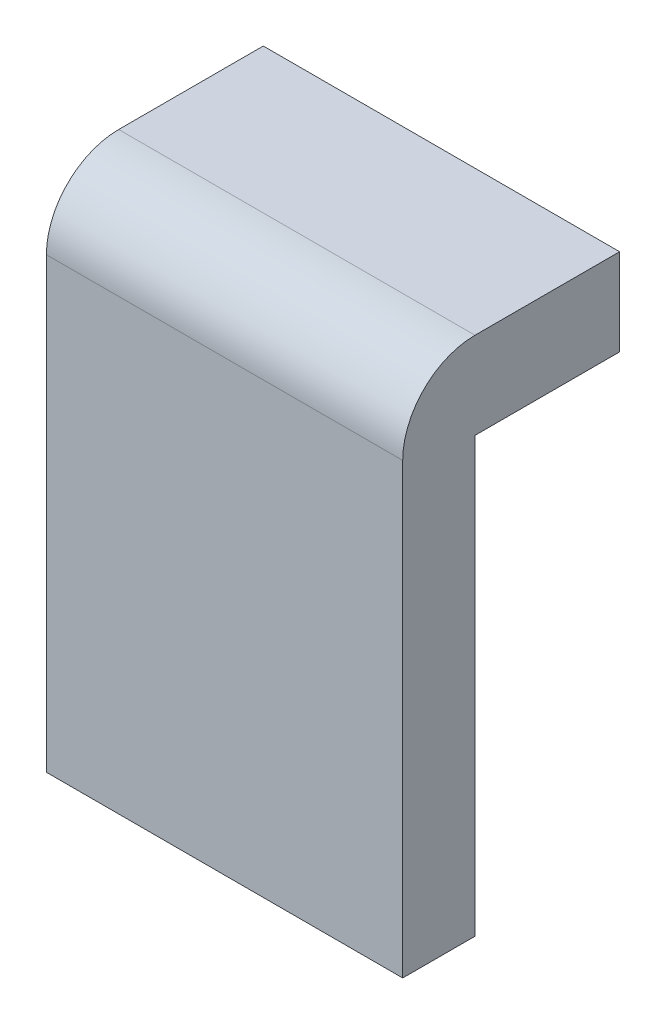
ISO-10303-21;
HEADER;
FILE_DESCRIPTION(('STEP AP214'),'2;1');
FILE_NAME('part.step','',(''),(''),'','','');
FILE_SCHEMA(('AUTOMOTIVE_DESIGN { 1 0 10303 214 1 1 1 1 }'));
ENDSEC;
DATA;
#1=APPLICATION_CONTEXT('core data for automotive mechanical design processes');
#2=APPLICATION_PROTOCOL_DEFINITION('international standard','automotive_design',2000,#1);
#3=PRODUCT_CONTEXT('',#1,'mechanical');
#4=PRODUCT('Part','Part','',(#3));
#5=PRODUCT_RELATED_PRODUCT_CATEGORY('part','',(#4));
#6=PRODUCT_DEFINITION_FORMATION('','',#4);
#7=PRODUCT_DEFINITION_CONTEXT('part definition',#1,'design');
#8=PRODUCT_DEFINITION('design','',#6,#7);
#9=PRODUCT_DEFINITION_SHAPE('','',#8);
#10=(LENGTH_UNIT() NAMED_UNIT(*) SI_UNIT(.MILLI.,.METRE.));
#11=(NAMED_UNIT(*) PLANE_ANGLE_UNIT() SI_UNIT($,.RADIAN.));
#12=(NAMED_UNIT(*) SI_UNIT($,.STERADIAN.) SOLID_ANGLE_UNIT());
#13=UNCERTAINTY_MEASURE_WITH_UNIT(LENGTH_MEASURE(1.E-05),#10,'distance_accuracy_value','');
#14=(GEOMETRIC_REPRESENTATION_CONTEXT(3) GLOBAL_UNCERTAINTY_ASSIGNED_CONTEXT((#13)) GLOBAL_UNIT_ASSIGNED_CONTEXT((#10,
#11,#12)) REPRESENTATION_CONTEXT('',''));
#15=CARTESIAN_POINT('',(0.,0.,0.));
#16=DIRECTION('',(0.,0.,1.));
#17=DIRECTION('',(1.,0.,0.));
#18=AXIS2_PLACEMENT_3D('',#15,#16,#17);
#19=CARTESIAN_POINT('',(-8.34906661620967,8.30000000000001,12.2546737770755));
#20=DIRECTION('',(0.,0.,1.));
#21=DIRECTION('',(0.,-1.,0.));
#22=AXIS2_PLACEMENT_3D('',#19,#20,#21);
#23=PLANE('',#22);
#24=DIRECTION('',(1.,0.,0.));
#25=VECTOR('',#24,1.);
#26=CARTESIAN_POINT('',(-15.8147962412963,6.80000000000003,12.2546737770755));
#27=LINE('',#26,#25);
#28=CARTESIAN_POINT('',(26.7271967977103,6.80000000000003,12.2546737770755));
#29=VERTEX_POINT('',#28);
#30=CARTESIAN_POINT('',(27.959347554151,6.80000000000003,12.2546737770755));
#31=VERTEX_POINT('',#30);
#32=EDGE_CURVE('E113',#29,#31,#27,.T.);
#33=ORIENTED_EDGE('',*,*,#32,.F.);
#34=DIRECTION('',(0.,1.,0.));
#35=VECTOR('',#34,1.);
#36=CARTESIAN_POINT('',(26.7271967977103,5.35753839337147,12.2546737770755));
#37=LINE('',#36,#35);
#38=CARTESIAN_POINT('',(26.7271967977103,8.30000000000001,12.2546737770755));
#39=VERTEX_POINT('',#38);
#40=EDGE_CURVE('E148',#39,#29,#37,.F.);
#41=ORIENTED_EDGE('',*,*,#40,.F.);
#42=DIRECTION('',(1.,0.,0.));
#43=VECTOR('',#42,1.);
#44=CARTESIAN_POINT('',(-8.34906661620967,8.30000000000001,12.2546737770755));
#45=LINE('',#44,#43);
#46=CARTESIAN_POINT('',(27.959347554151,8.30000000000001,12.2546737770755));
#47=VERTEX_POINT('',#46);
#48=EDGE_CURVE('E133',#39,#47,#45,.T.);
#49=ORIENTED_EDGE('',*,*,#48,.T.);
#50=DIRECTION('',(0.,1.,0.));
#51=VECTOR('',#50,1.);
#52=CARTESIAN_POINT('',(27.959347554151,5.35753839337147,12.2546737770755));
#53=LINE('',#52,#51);
#54=EDGE_CURVE('E105',#31,#47,#53,.T.);
#55=ORIENTED_EDGE('',*,*,#54,.F.);
#56=EDGE_LOOP('',(#33,#41,#49,#55));
#57=FACE_BOUND('',#56,.T.);
#58=ADVANCED_FACE('F17',(#57),#23,.F.);
#59=CARTESIAN_POINT('',(-8.34906661620967,8.30000000000001,11.7546737770755));
#60=DIRECTION('',(0.,1.,0.));
#61=DIRECTION('',(0.,0.,1.));
#62=AXIS2_PLACEMENT_3D('',#59,#60,#61);
#63=PLANE('',#62);
#64=ORIENTED_EDGE('',*,*,#48,.F.);
#65=DIRECTION('',(0.,0.,1.));
#66=VECTOR('',#65,1.);
#67=CARTESIAN_POINT('',(26.7271967977103,8.30000000000001,12.5046737770755));
#68=LINE('',#67,#66);
#69=CARTESIAN_POINT('',(26.7271967977103,8.30000000000001,11.7546737770755));
#70=VERTEX_POINT('',#69);
#71=EDGE_CURVE('E153',#70,#39,#68,.T.);
#72=ORIENTED_EDGE('',*,*,#71,.F.);
#73=DIRECTION('',(1.,0.,0.));
#74=VECTOR('',#73,1.);
#75=CARTESIAN_POINT('',(26.7271967977103,8.30000000000001,11.7546737770755));
#76=LINE('',#75,#74);
#77=CARTESIAN_POINT('',(27.959347554151,8.30000000000001,11.7546737770755));
#78=VERTEX_POINT('',#77);
#79=EDGE_CURVE('E124',#78,#70,#76,.F.);
#80=ORIENTED_EDGE('',*,*,#79,.F.);
#81=DIRECTION('',(0.,0.,-1.));
#82=VECTOR('',#81,1.);
#83=CARTESIAN_POINT('',(27.959347554151,8.30000000000001,12.5046737770755));
#84=LINE('',#83,#82);
#85=EDGE_CURVE('E129',#47,#78,#84,.T.);
#86=ORIENTED_EDGE('',*,*,#85,.F.);
#87=EDGE_LOOP('',(#64,#72,#80,#86));
#88=FACE_BOUND('',#87,.T.);
#89=ADVANCED_FACE('F175',(#88),#63,.F.);
#90=CARTESIAN_POINT('',(26.7271967977103,5.35753839337146,11.7546737770755));
#91=DIRECTION('',(0.,0.,-1.));
#92=DIRECTION('',(0.,1.,0.));
#93=AXIS2_PLACEMENT_3D('',#90,#91,#92);
#94=PLANE('',#93);
#95=ORIENTED_EDGE('',*,*,#79,.T.);
#96=DIRECTION('',(0.,1.,0.));
#97=VECTOR('',#96,1.);
#98=CARTESIAN_POINT('',(26.7271967977103,5.35753839337147,11.7546737770755));
#99=LINE('',#98,#97);
#100=CARTESIAN_POINT('',(26.7271967977103,8.6,11.7546737770755));
#101=VERTEX_POINT('',#100);
#102=EDGE_CURVE('E119',#101,#70,#99,.F.);
#103=ORIENTED_EDGE('',*,*,#102,.F.);
#104=DIRECTION('',(1.,0.,0.));
#105=VECTOR('',#104,1.);
#106=CARTESIAN_POINT('',(-8.34906661620967,8.6,11.7546737770755));
#107=LINE('',#106,#105);
#108=CARTESIAN_POINT('',(27.959347554151,8.6,11.7546737770755));
#109=VERTEX_POINT('',#108);
#110=EDGE_CURVE('E122',#101,#109,#107,.T.);
#111=ORIENTED_EDGE('',*,*,#110,.T.);
#112=DIRECTION('',(0.,1.,0.));
#113=VECTOR('',#112,1.);
#114=CARTESIAN_POINT('',(27.959347554151,5.35753839337147,11.7546737770755));
#115=LINE('',#114,#113);
#116=EDGE_CURVE('E97',#78,#109,#115,.T.);
#117=ORIENTED_EDGE('',*,*,#116,.F.);
#118=EDGE_LOOP('',(#95,#103,#111,#117));
#119=FACE_BOUND('',#118,.T.);
#120=ADVANCED_FACE('F172',(#119),#94,.T.);
#121=CARTESIAN_POINT('',(-8.34906661620967,8.6,11.7546737770755));
#122=DIRECTION('',(0.,-1.,0.));
#123=DIRECTION('',(0.,0.,-1.));
#124=AXIS2_PLACEMENT_3D('',#121,#122,#123);
#125=PLANE('',#124);
#126=ORIENTED_EDGE('',*,*,#110,.F.);
#127=DIRECTION('',(0.,0.,1.));
#128=VECTOR('',#127,1.);
#129=CARTESIAN_POINT('',(26.7271967977103,8.6,12.5046737770755));
#130=LINE('',#129,#128);
#131=CARTESIAN_POINT('',(26.7271967977103,8.6,12.2546737770755));
#132=VERTEX_POINT('',#131);
#133=EDGE_CURVE('E83',#132,#101,#130,.F.);
#134=ORIENTED_EDGE('',*,*,#133,.F.);
#135=DIRECTION('',(1.,0.,0.));
#136=VECTOR('',#135,1.);
#137=CARTESIAN_POINT('',(-8.34906661620967,8.6,12.2546737770755));
#138=LINE('',#137,#136);
#139=CARTESIAN_POINT('',(27.959347554151,8.6,12.2546737770755));
#140=VERTEX_POINT('',#139);
#141=EDGE_CURVE('E79',#140,#132,#138,.F.);
#142=ORIENTED_EDGE('',*,*,#141,.F.);
#143=DIRECTION('',(0.,0.,-1.));
#144=VECTOR('',#143,1.);
#145=CARTESIAN_POINT('',(27.959347554151,8.6,12.5046737770755));
#146=LINE('',#145,#144);
#147=EDGE_CURVE('E94',#109,#140,#146,.F.);
#148=ORIENTED_EDGE('',*,*,#147,.F.);
#149=EDGE_LOOP('',(#126,#134,#142,#148));
#150=FACE_BOUND('',#149,.T.);
#151=ADVANCED_FACE('F168',(#150),#125,.F.);
#152=CARTESIAN_POINT('',(-8.34906661620967,8.35,12.2546737770755));
#153=DIRECTION('',(1.,0.,0.));
#154=DIRECTION('',(0.,0.,-1.));
#155=AXIS2_PLACEMENT_3D('',#152,#153,#154);
#156=CYLINDRICAL_SURFACE('',#155,0.249999999999995);
#157=CARTESIAN_POINT('',(26.7271967977103,8.35,12.2546737770755));
#158=DIRECTION('',(1.,0.,0.));
#159=DIRECTION('',(0.,0.,-1.));
#160=AXIS2_PLACEMENT_3D('',#157,#158,#159);
#161=CIRCLE('',#160,0.249999999999995);
#162=CARTESIAN_POINT('',(26.7271967977103,8.35,12.5046737770755));
#163=VERTEX_POINT('',#162);
#164=EDGE_CURVE('E20',#163,#132,#161,.F.);
#165=ORIENTED_EDGE('',*,*,#164,.F.);
#166=DIRECTION('',(1.,0.,0.));
#167=VECTOR('',#166,1.);
#168=CARTESIAN_POINT('',(26.7271967977103,8.35,12.5046737770755));
#169=LINE('',#168,#167);
#170=CARTESIAN_POINT('',(27.959347554151,8.35,12.5046737770755));
#171=VERTEX_POINT('',#170);
#172=EDGE_CURVE('E77',#171,#163,#169,.F.);
#173=ORIENTED_EDGE('',*,*,#172,.F.);
#174=CARTESIAN_POINT('',(27.959347554151,8.35,12.2546737770755));
#175=DIRECTION('',(1.,0.,0.));
#176=DIRECTION('',(0.,0.,-1.));
#177=AXIS2_PLACEMENT_3D('',#174,#175,#176);
#178=CIRCLE('',#177,0.249999999999995);
#179=EDGE_CURVE('E106',#140,#171,#178,.T.);
#180=ORIENTED_EDGE('',*,*,#179,.F.);
#181=ORIENTED_EDGE('',*,*,#141,.T.);
#182=EDGE_LOOP('',(#165,#173,#180,#181));
#183=FACE_BOUND('',#182,.T.);
#184=ADVANCED_FACE('F74',(#183),#156,.T.);
#185=CARTESIAN_POINT('',(26.7271967977103,5.35753839337147,12.5046737770755));
#186=DIRECTION('',(-1.,0.,0.));
#187=DIRECTION('',(0.,0.,1.));
#188=AXIS2_PLACEMENT_3D('',#185,#186,#187);
#189=PLANE('',#188);
#190=DIRECTION('',(0.,0.,-1.));
#191=VECTOR('',#190,1.);
#192=CARTESIAN_POINT('',(26.7271967977103,6.80000000000003,12.5046737770755));
#193=LINE('',#192,#191);
#194=CARTESIAN_POINT('',(26.7271967977103,6.80000000000003,12.5046737770755));
#195=VERTEX_POINT('',#194);
#196=EDGE_CURVE('E89',#195,#29,#193,.T.);
#197=ORIENTED_EDGE('',*,*,#196,.F.);
#198=DIRECTION('',(0.,-1.,0.));
#199=VECTOR('',#198,1.);
#200=CARTESIAN_POINT('',(26.7271967977103,5.35753839337147,12.5046737770755));
#201=LINE('',#200,#199);
#202=EDGE_CURVE('E85',#163,#195,#201,.T.);
#203=ORIENTED_EDGE('',*,*,#202,.F.);
#204=ORIENTED_EDGE('',*,*,#164,.T.);
#205=ORIENTED_EDGE('',*,*,#133,.T.);
#206=ORIENTED_EDGE('',*,*,#102,.T.);
#207=ORIENTED_EDGE('',*,*,#71,.T.);
#208=ORIENTED_EDGE('',*,*,#40,.T.);
#209=EDGE_LOOP('',(#197,#203,#204,#205,#206,#207,#208));
#210=FACE_BOUND('',#209,.T.);
#211=ADVANCED_FACE('F86',(#210),#189,.T.);
#212=CARTESIAN_POINT('',(-15.8147962412963,6.80000000000003,12.5046737770755));
#213=DIRECTION('',(0.,-1.,0.));
#214=DIRECTION('',(0.,0.,-1.));
#215=AXIS2_PLACEMENT_3D('',#212,#213,#214);
#216=PLANE('',#215);
#217=DIRECTION('',(1.,0.,0.));
#218=VECTOR('',#217,1.);
#219=CARTESIAN_POINT('',(26.7271967977103,6.80000000000003,12.5046737770755));
#220=LINE('',#219,#218);
#221=CARTESIAN_POINT('',(27.959347554151,6.80000000000003,12.5046737770755));
#222=VERTEX_POINT('',#221);
#223=EDGE_CURVE('E26',#195,#222,#220,.T.);
#224=ORIENTED_EDGE('',*,*,#223,.F.);
#225=ORIENTED_EDGE('',*,*,#196,.T.);
#226=ORIENTED_EDGE('',*,*,#32,.T.);
#227=DIRECTION('',(0.,0.,-1.));
#228=VECTOR('',#227,1.);
#229=CARTESIAN_POINT('',(27.959347554151,6.80000000000003,12.5046737770755));
#230=LINE('',#229,#228);
#231=EDGE_CURVE('E35',#222,#31,#230,.T.);
#232=ORIENTED_EDGE('',*,*,#231,.F.);
#233=EDGE_LOOP('',(#224,#225,#226,#232));
#234=FACE_BOUND('',#233,.T.);
#235=ADVANCED_FACE('F179',(#234),#216,.T.);
#236=CARTESIAN_POINT('',(27.959347554151,5.35753839337147,12.5046737770755));
#237=DIRECTION('',(1.,0.,0.));
#238=DIRECTION('',(0.,0.,-1.));
#239=AXIS2_PLACEMENT_3D('',#236,#237,#238);
#240=PLANE('',#239);
#241=ORIENTED_EDGE('',*,*,#116,.T.);
#242=ORIENTED_EDGE('',*,*,#147,.T.);
#243=ORIENTED_EDGE('',*,*,#179,.T.);
#244=DIRECTION('',(0.,-1.,0.));
#245=VECTOR('',#244,1.);
#246=CARTESIAN_POINT('',(27.959347554151,5.35753839337147,12.5046737770755));
#247=LINE('',#246,#245);
#248=EDGE_CURVE('E11',#222,#171,#247,.F.);
#249=ORIENTED_EDGE('',*,*,#248,.F.);
#250=ORIENTED_EDGE('',*,*,#231,.T.);
#251=ORIENTED_EDGE('',*,*,#54,.T.);
#252=ORIENTED_EDGE('',*,*,#85,.T.);
#253=EDGE_LOOP('',(#241,#242,#243,#249,#250,#251,#252));
#254=FACE_BOUND('',#253,.T.);
#255=ADVANCED_FACE('F164',(#254),#240,.T.);
#256=CARTESIAN_POINT('',(26.7271967977103,5.35753839337147,12.5046737770755));
#257=DIRECTION('',(0.,0.,1.));
#258=DIRECTION('',(0.,-1.,0.));
#259=AXIS2_PLACEMENT_3D('',#256,#257,#258);
#260=PLANE('',#259);
#261=ORIENTED_EDGE('',*,*,#223,.T.);
#262=ORIENTED_EDGE('',*,*,#248,.T.);
#263=ORIENTED_EDGE('',*,*,#172,.T.);
#264=ORIENTED_EDGE('',*,*,#202,.T.);
#265=EDGE_LOOP('',(#261,#262,#263,#264));
#266=FACE_BOUND('',#265,.T.);
#267=ADVANCED_FACE('F93',(#266),#260,.T.);
#268=CLOSED_SHELL('',(#58,#89,#120,#151,#184,#211,#235,#255,#267));
#269=MANIFOLD_SOLID_BREP('B1',#268);
#270=ADVANCED_BREP_SHAPE_REPRESENTATION('',(#18,#269),#14);
#271=SHAPE_DEFINITION_REPRESENTATION(#9,#270);
ENDSEC;
END-ISO-10303-21;
